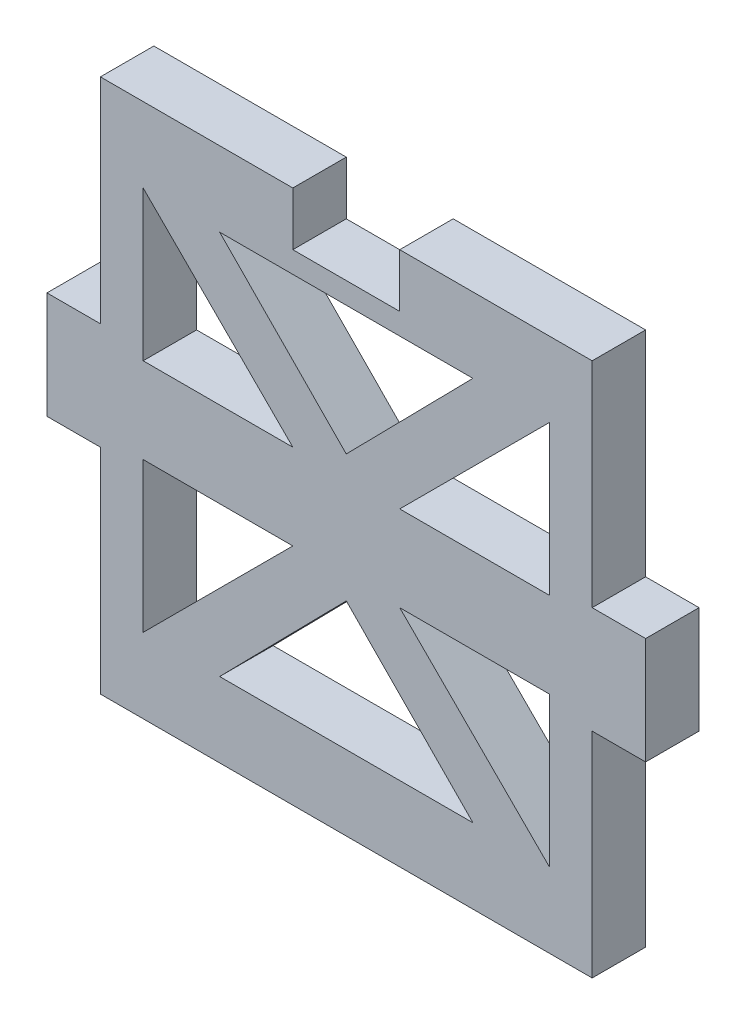
ISO-10303-21;
HEADER;
FILE_DESCRIPTION(('STEP AP214'),'2;1');
FILE_NAME('part.step','',(''),(''),'','','');
FILE_SCHEMA(('AUTOMOTIVE_DESIGN { 1 0 10303 214 1 1 1 1 }'));
ENDSEC;
DATA;
#1=APPLICATION_CONTEXT('core data for automotive mechanical design processes');
#2=APPLICATION_PROTOCOL_DEFINITION('international standard','automotive_design',2000,#1);
#3=PRODUCT_CONTEXT('',#1,'mechanical');
#4=PRODUCT('Part','Part','',(#3));
#5=PRODUCT_RELATED_PRODUCT_CATEGORY('part','',(#4));
#6=PRODUCT_DEFINITION_FORMATION('','',#4);
#7=PRODUCT_DEFINITION_CONTEXT('part definition',#1,'design');
#8=PRODUCT_DEFINITION('design','',#6,#7);
#9=PRODUCT_DEFINITION_SHAPE('','',#8);
#10=(LENGTH_UNIT() NAMED_UNIT(*) SI_UNIT(.MILLI.,.METRE.));
#11=(NAMED_UNIT(*) PLANE_ANGLE_UNIT() SI_UNIT($,.RADIAN.));
#12=(NAMED_UNIT(*) SI_UNIT($,.STERADIAN.) SOLID_ANGLE_UNIT());
#13=UNCERTAINTY_MEASURE_WITH_UNIT(LENGTH_MEASURE(1.E-05),#10,'distance_accuracy_value','');
#14=(GEOMETRIC_REPRESENTATION_CONTEXT(3) GLOBAL_UNCERTAINTY_ASSIGNED_CONTEXT((#13)) GLOBAL_UNIT_ASSIGNED_CONTEXT((#10,
#11,#12)) REPRESENTATION_CONTEXT('',''));
#15=CARTESIAN_POINT('',(0.,0.,0.));
#16=DIRECTION('',(0.,0.,1.));
#17=DIRECTION('',(1.,0.,0.));
#18=AXIS2_PLACEMENT_3D('',#15,#16,#17);
#19=CARTESIAN_POINT('',(-14.605,15.875,3.175));
#20=DIRECTION('',(1.,0.,0.));
#21=DIRECTION('',(0.,1.,0.));
#22=AXIS2_PLACEMENT_3D('',#19,#20,#21);
#23=PLANE('',#22);
#24=DIRECTION('',(0.,-1.,0.));
#25=VECTOR('',#24,1.);
#26=CARTESIAN_POINT('',(-14.605,15.875,0.));
#27=LINE('',#26,#25);
#28=CARTESIAN_POINT('',(-14.605,15.875,0.));
#29=VERTEX_POINT('',#28);
#30=CARTESIAN_POINT('',(-14.605,3.175,0.));
#31=VERTEX_POINT('',#30);
#32=EDGE_CURVE('E398',#29,#31,#27,.T.);
#33=ORIENTED_EDGE('',*,*,#32,.T.);
#34=DIRECTION('',(0.,0.,-1.));
#35=VECTOR('',#34,1.);
#36=CARTESIAN_POINT('',(-14.605,3.175,3.175));
#37=LINE('',#36,#35);
#38=CARTESIAN_POINT('',(-14.605,3.175,3.175));
#39=VERTEX_POINT('',#38);
#40=EDGE_CURVE('E11',#39,#31,#37,.T.);
#41=ORIENTED_EDGE('',*,*,#40,.F.);
#42=DIRECTION('',(0.,-1.,0.));
#43=VECTOR('',#42,1.);
#44=CARTESIAN_POINT('',(-14.605,15.875,3.175));
#45=LINE('',#44,#43);
#46=CARTESIAN_POINT('',(-14.605,15.875,3.175));
#47=VERTEX_POINT('',#46);
#48=EDGE_CURVE('E399',#47,#39,#45,.T.);
#49=ORIENTED_EDGE('',*,*,#48,.F.);
#50=DIRECTION('',(0.,0.,-1.));
#51=VECTOR('',#50,1.);
#52=CARTESIAN_POINT('',(-14.605,15.875,3.175));
#53=LINE('',#52,#51);
#54=EDGE_CURVE('E433',#47,#29,#53,.T.);
#55=ORIENTED_EDGE('',*,*,#54,.T.);
#56=EDGE_LOOP('',(#33,#41,#49,#55));
#57=FACE_BOUND('',#56,.T.);
#58=ADVANCED_FACE('F32',(#57),#23,.F.);
#59=CARTESIAN_POINT('',(-14.605,3.175,3.175));
#60=DIRECTION('',(0.,-1.,0.));
#61=DIRECTION('',(0.,0.,-1.));
#62=AXIS2_PLACEMENT_3D('',#59,#60,#61);
#63=PLANE('',#62);
#64=DIRECTION('',(-1.,0.,0.));
#65=VECTOR('',#64,1.);
#66=CARTESIAN_POINT('',(-14.605,3.175,0.));
#67=LINE('',#66,#65);
#68=CARTESIAN_POINT('',(-17.78,3.175,0.));
#69=VERTEX_POINT('',#68);
#70=EDGE_CURVE('E436',#31,#69,#67,.T.);
#71=ORIENTED_EDGE('',*,*,#70,.T.);
#72=DIRECTION('',(0.,0.,-1.));
#73=VECTOR('',#72,1.);
#74=CARTESIAN_POINT('',(-17.78,3.175,3.175));
#75=LINE('',#74,#73);
#76=CARTESIAN_POINT('',(-17.78,3.175,3.175));
#77=VERTEX_POINT('',#76);
#78=EDGE_CURVE('E39',#77,#69,#75,.T.);
#79=ORIENTED_EDGE('',*,*,#78,.F.);
#80=DIRECTION('',(-1.,0.,0.));
#81=VECTOR('',#80,1.);
#82=CARTESIAN_POINT('',(-14.605,3.175,3.175));
#83=LINE('',#82,#81);
#84=EDGE_CURVE('E402',#39,#77,#83,.T.);
#85=ORIENTED_EDGE('',*,*,#84,.F.);
#86=ORIENTED_EDGE('',*,*,#40,.T.);
#87=EDGE_LOOP('',(#71,#79,#85,#86));
#88=FACE_BOUND('',#87,.T.);
#89=ADVANCED_FACE('F532',(#88),#63,.F.);
#90=CARTESIAN_POINT('',(-17.78,3.175,3.175));
#91=DIRECTION('',(1.,0.,0.));
#92=DIRECTION('',(0.,0.,-1.));
#93=AXIS2_PLACEMENT_3D('',#90,#91,#92);
#94=PLANE('',#93);
#95=DIRECTION('',(0.,-1.,0.));
#96=VECTOR('',#95,1.);
#97=CARTESIAN_POINT('',(-17.78,3.175,0.));
#98=LINE('',#97,#96);
#99=CARTESIAN_POINT('',(-17.78,-3.175,0.));
#100=VERTEX_POINT('',#99);
#101=EDGE_CURVE('E438',#69,#100,#98,.T.);
#102=ORIENTED_EDGE('',*,*,#101,.T.);
#103=DIRECTION('',(0.,0.,-1.));
#104=VECTOR('',#103,1.);
#105=CARTESIAN_POINT('',(-17.78,-3.175,3.175));
#106=LINE('',#105,#104);
#107=CARTESIAN_POINT('',(-17.78,-3.175,3.175));
#108=VERTEX_POINT('',#107);
#109=EDGE_CURVE('E504',#108,#100,#106,.T.);
#110=ORIENTED_EDGE('',*,*,#109,.F.);
#111=DIRECTION('',(0.,-1.,0.));
#112=VECTOR('',#111,1.);
#113=CARTESIAN_POINT('',(-17.78,3.175,3.175));
#114=LINE('',#113,#112);
#115=EDGE_CURVE('E405',#77,#108,#114,.T.);
#116=ORIENTED_EDGE('',*,*,#115,.F.);
#117=ORIENTED_EDGE('',*,*,#78,.T.);
#118=EDGE_LOOP('',(#102,#110,#116,#117));
#119=FACE_BOUND('',#118,.T.);
#120=ADVANCED_FACE('F511',(#119),#94,.F.);
#121=CARTESIAN_POINT('',(-14.605,-3.175,3.175));
#122=DIRECTION('',(0.,1.,0.));
#123=DIRECTION('',(0.,0.,1.));
#124=AXIS2_PLACEMENT_3D('',#121,#122,#123);
#125=PLANE('',#124);
#126=DIRECTION('',(1.,0.,0.));
#127=VECTOR('',#126,1.);
#128=CARTESIAN_POINT('',(-14.605,-3.175,0.));
#129=LINE('',#128,#127);
#130=CARTESIAN_POINT('',(-14.605,-3.175,0.));
#131=VERTEX_POINT('',#130);
#132=EDGE_CURVE('E440',#100,#131,#129,.T.);
#133=ORIENTED_EDGE('',*,*,#132,.T.);
#134=DIRECTION('',(0.,0.,-1.));
#135=VECTOR('',#134,1.);
#136=CARTESIAN_POINT('',(-14.605,-3.175,3.175));
#137=LINE('',#136,#135);
#138=CARTESIAN_POINT('',(-14.605,-3.175,3.175));
#139=VERTEX_POINT('',#138);
#140=EDGE_CURVE('E501',#139,#131,#137,.T.);
#141=ORIENTED_EDGE('',*,*,#140,.F.);
#142=DIRECTION('',(1.,0.,0.));
#143=VECTOR('',#142,1.);
#144=CARTESIAN_POINT('',(-14.605,-3.175,3.175));
#145=LINE('',#144,#143);
#146=EDGE_CURVE('E407',#108,#139,#145,.T.);
#147=ORIENTED_EDGE('',*,*,#146,.F.);
#148=ORIENTED_EDGE('',*,*,#109,.T.);
#149=EDGE_LOOP('',(#133,#141,#147,#148));
#150=FACE_BOUND('',#149,.T.);
#151=ADVANCED_FACE('F520',(#150),#125,.F.);
#152=CARTESIAN_POINT('',(-14.605,-15.875,3.175));
#153=DIRECTION('',(1.,0.,0.));
#154=DIRECTION('',(0.,1.,0.));
#155=AXIS2_PLACEMENT_3D('',#152,#153,#154);
#156=PLANE('',#155);
#157=DIRECTION('',(0.,-1.,0.));
#158=VECTOR('',#157,1.);
#159=CARTESIAN_POINT('',(-14.605,-15.875,0.));
#160=LINE('',#159,#158);
#161=CARTESIAN_POINT('',(-14.605,-15.875,0.));
#162=VERTEX_POINT('',#161);
#163=EDGE_CURVE('E442',#131,#162,#160,.T.);
#164=ORIENTED_EDGE('',*,*,#163,.T.);
#165=DIRECTION('',(0.,0.,-1.));
#166=VECTOR('',#165,1.);
#167=CARTESIAN_POINT('',(-14.605,-15.875,3.175));
#168=LINE('',#167,#166);
#169=CARTESIAN_POINT('',(-14.605,-15.875,3.175));
#170=VERTEX_POINT('',#169);
#171=EDGE_CURVE('E498',#170,#162,#168,.T.);
#172=ORIENTED_EDGE('',*,*,#171,.F.);
#173=DIRECTION('',(0.,-1.,0.));
#174=VECTOR('',#173,1.);
#175=CARTESIAN_POINT('',(-14.605,-15.875,3.175));
#176=LINE('',#175,#174);
#177=EDGE_CURVE('E409',#139,#170,#176,.T.);
#178=ORIENTED_EDGE('',*,*,#177,.F.);
#179=ORIENTED_EDGE('',*,*,#140,.T.);
#180=EDGE_LOOP('',(#164,#172,#178,#179));
#181=FACE_BOUND('',#180,.T.);
#182=ADVANCED_FACE('F524',(#181),#156,.F.);
#183=CARTESIAN_POINT('',(14.605,-15.875,3.175));
#184=DIRECTION('',(0.,1.,0.));
#185=DIRECTION('',(-1.,0.,0.));
#186=AXIS2_PLACEMENT_3D('',#183,#184,#185);
#187=PLANE('',#186);
#188=DIRECTION('',(1.,0.,0.));
#189=VECTOR('',#188,1.);
#190=CARTESIAN_POINT('',(14.605,-15.875,0.));
#191=LINE('',#190,#189);
#192=CARTESIAN_POINT('',(14.605,-15.875,0.));
#193=VERTEX_POINT('',#192);
#194=EDGE_CURVE('E445',#162,#193,#191,.T.);
#195=ORIENTED_EDGE('',*,*,#194,.T.);
#196=DIRECTION('',(0.,0.,-1.));
#197=VECTOR('',#196,1.);
#198=CARTESIAN_POINT('',(14.605,-15.875,3.175));
#199=LINE('',#198,#197);
#200=CARTESIAN_POINT('',(14.605,-15.875,3.175));
#201=VERTEX_POINT('',#200);
#202=EDGE_CURVE('E495',#201,#193,#199,.T.);
#203=ORIENTED_EDGE('',*,*,#202,.F.);
#204=DIRECTION('',(1.,0.,0.));
#205=VECTOR('',#204,1.);
#206=CARTESIAN_POINT('',(-14.605,-15.875,3.175));
#207=LINE('',#206,#205);
#208=EDGE_CURVE('E411',#170,#201,#207,.T.);
#209=ORIENTED_EDGE('',*,*,#208,.F.);
#210=ORIENTED_EDGE('',*,*,#171,.T.);
#211=EDGE_LOOP('',(#195,#203,#209,#210));
#212=FACE_BOUND('',#211,.T.);
#213=ADVANCED_FACE('F585',(#212),#187,.F.);
#214=CARTESIAN_POINT('',(14.605,-15.875,3.175));
#215=DIRECTION('',(-1.,0.,0.));
#216=DIRECTION('',(0.,-1.,0.));
#217=AXIS2_PLACEMENT_3D('',#214,#215,#216);
#218=PLANE('',#217);
#219=DIRECTION('',(0.,1.,0.));
#220=VECTOR('',#219,1.);
#221=CARTESIAN_POINT('',(14.605,-15.875,0.));
#222=LINE('',#221,#220);
#223=CARTESIAN_POINT('',(14.605,-3.175,0.));
#224=VERTEX_POINT('',#223);
#225=EDGE_CURVE('E447',#193,#224,#222,.T.);
#226=ORIENTED_EDGE('',*,*,#225,.T.);
#227=DIRECTION('',(0.,0.,-1.));
#228=VECTOR('',#227,1.);
#229=CARTESIAN_POINT('',(14.605,-3.175,3.175));
#230=LINE('',#229,#228);
#231=CARTESIAN_POINT('',(14.605,-3.175,3.175));
#232=VERTEX_POINT('',#231);
#233=EDGE_CURVE('E492',#232,#224,#230,.T.);
#234=ORIENTED_EDGE('',*,*,#233,.F.);
#235=DIRECTION('',(0.,1.,0.));
#236=VECTOR('',#235,1.);
#237=CARTESIAN_POINT('',(14.605,-15.875,3.175));
#238=LINE('',#237,#236);
#239=EDGE_CURVE('E413',#201,#232,#238,.T.);
#240=ORIENTED_EDGE('',*,*,#239,.F.);
#241=ORIENTED_EDGE('',*,*,#202,.T.);
#242=EDGE_LOOP('',(#226,#234,#240,#241));
#243=FACE_BOUND('',#242,.T.);
#244=ADVANCED_FACE('F582',(#243),#218,.F.);
#245=CARTESIAN_POINT('',(14.605,-3.175,3.175));
#246=DIRECTION('',(0.,1.,0.));
#247=DIRECTION('',(0.,0.,1.));
#248=AXIS2_PLACEMENT_3D('',#245,#246,#247);
#249=PLANE('',#248);
#250=DIRECTION('',(1.,0.,0.));
#251=VECTOR('',#250,1.);
#252=CARTESIAN_POINT('',(14.605,-3.175,0.));
#253=LINE('',#252,#251);
#254=CARTESIAN_POINT('',(17.78,-3.175,0.));
#255=VERTEX_POINT('',#254);
#256=EDGE_CURVE('E449',#224,#255,#253,.T.);
#257=ORIENTED_EDGE('',*,*,#256,.T.);
#258=DIRECTION('',(0.,0.,-1.));
#259=VECTOR('',#258,1.);
#260=CARTESIAN_POINT('',(17.78,-3.175,3.175));
#261=LINE('',#260,#259);
#262=CARTESIAN_POINT('',(17.78,-3.175,3.175));
#263=VERTEX_POINT('',#262);
#264=EDGE_CURVE('E489',#263,#255,#261,.T.);
#265=ORIENTED_EDGE('',*,*,#264,.F.);
#266=DIRECTION('',(1.,0.,0.));
#267=VECTOR('',#266,1.);
#268=CARTESIAN_POINT('',(14.605,-3.175,3.175));
#269=LINE('',#268,#267);
#270=EDGE_CURVE('E415',#232,#263,#269,.T.);
#271=ORIENTED_EDGE('',*,*,#270,.F.);
#272=ORIENTED_EDGE('',*,*,#233,.T.);
#273=EDGE_LOOP('',(#257,#265,#271,#272));
#274=FACE_BOUND('',#273,.T.);
#275=ADVANCED_FACE('F578',(#274),#249,.F.);
#276=CARTESIAN_POINT('',(17.78,3.175,3.175));
#277=DIRECTION('',(-1.,0.,0.));
#278=DIRECTION('',(0.,0.,1.));
#279=AXIS2_PLACEMENT_3D('',#276,#277,#278);
#280=PLANE('',#279);
#281=DIRECTION('',(0.,1.,0.));
#282=VECTOR('',#281,1.);
#283=CARTESIAN_POINT('',(17.78,3.175,0.));
#284=LINE('',#283,#282);
#285=CARTESIAN_POINT('',(17.78,3.175,0.));
#286=VERTEX_POINT('',#285);
#287=EDGE_CURVE('E451',#255,#286,#284,.T.);
#288=ORIENTED_EDGE('',*,*,#287,.T.);
#289=DIRECTION('',(0.,0.,-1.));
#290=VECTOR('',#289,1.);
#291=CARTESIAN_POINT('',(17.78,3.175,3.175));
#292=LINE('',#291,#290);
#293=CARTESIAN_POINT('',(17.78,3.175,3.175));
#294=VERTEX_POINT('',#293);
#295=EDGE_CURVE('E486',#294,#286,#292,.T.);
#296=ORIENTED_EDGE('',*,*,#295,.F.);
#297=DIRECTION('',(0.,1.,0.));
#298=VECTOR('',#297,1.);
#299=CARTESIAN_POINT('',(17.78,3.175,3.175));
#300=LINE('',#299,#298);
#301=EDGE_CURVE('E417',#263,#294,#300,.T.);
#302=ORIENTED_EDGE('',*,*,#301,.F.);
#303=ORIENTED_EDGE('',*,*,#264,.T.);
#304=EDGE_LOOP('',(#288,#296,#302,#303));
#305=FACE_BOUND('',#304,.T.);
#306=ADVANCED_FACE('F574',(#305),#280,.F.);
#307=CARTESIAN_POINT('',(14.605,3.175,3.175));
#308=DIRECTION('',(0.,-1.,0.));
#309=DIRECTION('',(0.,0.,-1.));
#310=AXIS2_PLACEMENT_3D('',#307,#308,#309);
#311=PLANE('',#310);
#312=DIRECTION('',(-1.,0.,0.));
#313=VECTOR('',#312,1.);
#314=CARTESIAN_POINT('',(14.605,3.175,0.));
#315=LINE('',#314,#313);
#316=CARTESIAN_POINT('',(14.605,3.175,0.));
#317=VERTEX_POINT('',#316);
#318=EDGE_CURVE('E453',#286,#317,#315,.T.);
#319=ORIENTED_EDGE('',*,*,#318,.T.);
#320=DIRECTION('',(0.,0.,-1.));
#321=VECTOR('',#320,1.);
#322=CARTESIAN_POINT('',(14.605,3.175,3.175));
#323=LINE('',#322,#321);
#324=CARTESIAN_POINT('',(14.605,3.175,3.175));
#325=VERTEX_POINT('',#324);
#326=EDGE_CURVE('E483',#325,#317,#323,.T.);
#327=ORIENTED_EDGE('',*,*,#326,.F.);
#328=DIRECTION('',(-1.,0.,0.));
#329=VECTOR('',#328,1.);
#330=CARTESIAN_POINT('',(14.605,3.175,3.175));
#331=LINE('',#330,#329);
#332=EDGE_CURVE('E419',#294,#325,#331,.T.);
#333=ORIENTED_EDGE('',*,*,#332,.F.);
#334=ORIENTED_EDGE('',*,*,#295,.T.);
#335=EDGE_LOOP('',(#319,#327,#333,#334));
#336=FACE_BOUND('',#335,.T.);
#337=ADVANCED_FACE('F569',(#336),#311,.F.);
#338=CARTESIAN_POINT('',(14.605,15.875,3.175));
#339=DIRECTION('',(-1.,0.,0.));
#340=DIRECTION('',(0.,-1.,0.));
#341=AXIS2_PLACEMENT_3D('',#338,#339,#340);
#342=PLANE('',#341);
#343=DIRECTION('',(0.,1.,0.));
#344=VECTOR('',#343,1.);
#345=CARTESIAN_POINT('',(14.605,15.875,0.));
#346=LINE('',#345,#344);
#347=CARTESIAN_POINT('',(14.605,15.875,0.));
#348=VERTEX_POINT('',#347);
#349=EDGE_CURVE('E455',#317,#348,#346,.T.);
#350=ORIENTED_EDGE('',*,*,#349,.T.);
#351=DIRECTION('',(0.,0.,-1.));
#352=VECTOR('',#351,1.);
#353=CARTESIAN_POINT('',(14.605,15.875,3.175));
#354=LINE('',#353,#352);
#355=CARTESIAN_POINT('',(14.605,15.875,3.175));
#356=VERTEX_POINT('',#355);
#357=EDGE_CURVE('E480',#356,#348,#354,.T.);
#358=ORIENTED_EDGE('',*,*,#357,.F.);
#359=DIRECTION('',(0.,1.,0.));
#360=VECTOR('',#359,1.);
#361=CARTESIAN_POINT('',(14.605,15.875,3.175));
#362=LINE('',#361,#360);
#363=EDGE_CURVE('E421',#325,#356,#362,.T.);
#364=ORIENTED_EDGE('',*,*,#363,.F.);
#365=ORIENTED_EDGE('',*,*,#326,.T.);
#366=EDGE_LOOP('',(#350,#358,#364,#365));
#367=FACE_BOUND('',#366,.T.);
#368=ADVANCED_FACE('F563',(#367),#342,.F.);
#369=CARTESIAN_POINT('',(14.605,15.875,3.175));
#370=DIRECTION('',(0.,-1.,0.));
#371=DIRECTION('',(1.,0.,0.));
#372=AXIS2_PLACEMENT_3D('',#369,#370,#371);
#373=PLANE('',#372);
#374=DIRECTION('',(-1.,0.,0.));
#375=VECTOR('',#374,1.);
#376=CARTESIAN_POINT('',(14.605,15.875,0.));
#377=LINE('',#376,#375);
#378=CARTESIAN_POINT('',(3.175,15.875,0.));
#379=VERTEX_POINT('',#378);
#380=EDGE_CURVE('E457',#348,#379,#377,.T.);
#381=ORIENTED_EDGE('',*,*,#380,.T.);
#382=DIRECTION('',(0.,0.,-1.));
#383=VECTOR('',#382,1.);
#384=CARTESIAN_POINT('',(3.175,15.875,3.175));
#385=LINE('',#384,#383);
#386=CARTESIAN_POINT('',(3.175,15.875,3.175));
#387=VERTEX_POINT('',#386);
#388=EDGE_CURVE('E477',#387,#379,#385,.T.);
#389=ORIENTED_EDGE('',*,*,#388,.F.);
#390=DIRECTION('',(-1.,0.,0.));
#391=VECTOR('',#390,1.);
#392=CARTESIAN_POINT('',(14.605,15.875,3.175));
#393=LINE('',#392,#391);
#394=EDGE_CURVE('E423',#356,#387,#393,.T.);
#395=ORIENTED_EDGE('',*,*,#394,.F.);
#396=ORIENTED_EDGE('',*,*,#357,.T.);
#397=EDGE_LOOP('',(#381,#389,#395,#396));
#398=FACE_BOUND('',#397,.T.);
#399=ADVANCED_FACE('F559',(#398),#373,.F.);
#400=CARTESIAN_POINT('',(3.175,12.7,3.175));
#401=DIRECTION('',(1.,0.,0.));
#402=DIRECTION('',(0.,1.,0.));
#403=AXIS2_PLACEMENT_3D('',#400,#401,#402);
#404=PLANE('',#403);
#405=DIRECTION('',(0.,-1.,0.));
#406=VECTOR('',#405,1.);
#407=CARTESIAN_POINT('',(3.175,12.7,0.));
#408=LINE('',#407,#406);
#409=CARTESIAN_POINT('',(3.175,12.7,0.));
#410=VERTEX_POINT('',#409);
#411=EDGE_CURVE('E459',#379,#410,#408,.T.);
#412=ORIENTED_EDGE('',*,*,#411,.T.);
#413=DIRECTION('',(0.,0.,-1.));
#414=VECTOR('',#413,1.);
#415=CARTESIAN_POINT('',(3.175,12.7,3.175));
#416=LINE('',#415,#414);
#417=CARTESIAN_POINT('',(3.175,12.7,3.175));
#418=VERTEX_POINT('',#417);
#419=EDGE_CURVE('E474',#418,#410,#416,.T.);
#420=ORIENTED_EDGE('',*,*,#419,.F.);
#421=DIRECTION('',(0.,-1.,0.));
#422=VECTOR('',#421,1.);
#423=CARTESIAN_POINT('',(3.175,12.7,3.175));
#424=LINE('',#423,#422);
#425=EDGE_CURVE('E425',#387,#418,#424,.T.);
#426=ORIENTED_EDGE('',*,*,#425,.F.);
#427=ORIENTED_EDGE('',*,*,#388,.T.);
#428=EDGE_LOOP('',(#412,#420,#426,#427));
#429=FACE_BOUND('',#428,.T.);
#430=ADVANCED_FACE('F554',(#429),#404,.F.);
#431=CARTESIAN_POINT('',(-3.175,12.7,3.175));
#432=DIRECTION('',(0.,-1.,0.));
#433=DIRECTION('',(1.,0.,0.));
#434=AXIS2_PLACEMENT_3D('',#431,#432,#433);
#435=PLANE('',#434);
#436=DIRECTION('',(-1.,0.,0.));
#437=VECTOR('',#436,1.);
#438=CARTESIAN_POINT('',(-3.175,12.7,0.));
#439=LINE('',#438,#437);
#440=CARTESIAN_POINT('',(-3.175,12.7,0.));
#441=VERTEX_POINT('',#440);
#442=EDGE_CURVE('E461',#410,#441,#439,.T.);
#443=ORIENTED_EDGE('',*,*,#442,.T.);
#444=DIRECTION('',(0.,0.,-1.));
#445=VECTOR('',#444,1.);
#446=CARTESIAN_POINT('',(-3.175,12.7,3.175));
#447=LINE('',#446,#445);
#448=CARTESIAN_POINT('',(-3.175,12.7,3.175));
#449=VERTEX_POINT('',#448);
#450=EDGE_CURVE('E471',#449,#441,#447,.T.);
#451=ORIENTED_EDGE('',*,*,#450,.F.);
#452=DIRECTION('',(-1.,0.,0.));
#453=VECTOR('',#452,1.);
#454=CARTESIAN_POINT('',(-3.175,12.7,3.175));
#455=LINE('',#454,#453);
#456=EDGE_CURVE('E427',#418,#449,#455,.T.);
#457=ORIENTED_EDGE('',*,*,#456,.F.);
#458=ORIENTED_EDGE('',*,*,#419,.T.);
#459=EDGE_LOOP('',(#443,#451,#457,#458));
#460=FACE_BOUND('',#459,.T.);
#461=ADVANCED_FACE('F548',(#460),#435,.F.);
#462=CARTESIAN_POINT('',(-3.175,15.875,3.175));
#463=DIRECTION('',(-1.,0.,0.));
#464=DIRECTION('',(0.,-1.,0.));
#465=AXIS2_PLACEMENT_3D('',#462,#463,#464);
#466=PLANE('',#465);
#467=DIRECTION('',(0.,1.,0.));
#468=VECTOR('',#467,1.);
#469=CARTESIAN_POINT('',(-3.175,15.875,0.));
#470=LINE('',#469,#468);
#471=CARTESIAN_POINT('',(-3.175,15.875,0.));
#472=VERTEX_POINT('',#471);
#473=EDGE_CURVE('E463',#441,#472,#470,.T.);
#474=ORIENTED_EDGE('',*,*,#473,.T.);
#475=DIRECTION('',(0.,0.,-1.));
#476=VECTOR('',#475,1.);
#477=CARTESIAN_POINT('',(-3.175,15.875,3.175));
#478=LINE('',#477,#476);
#479=CARTESIAN_POINT('',(-3.175,15.875,3.175));
#480=VERTEX_POINT('',#479);
#481=EDGE_CURVE('E468',#480,#472,#478,.T.);
#482=ORIENTED_EDGE('',*,*,#481,.F.);
#483=DIRECTION('',(0.,1.,0.));
#484=VECTOR('',#483,1.);
#485=CARTESIAN_POINT('',(-3.175,15.875,3.175));
#486=LINE('',#485,#484);
#487=EDGE_CURVE('E429',#449,#480,#486,.T.);
#488=ORIENTED_EDGE('',*,*,#487,.F.);
#489=ORIENTED_EDGE('',*,*,#450,.T.);
#490=EDGE_LOOP('',(#474,#482,#488,#489));
#491=FACE_BOUND('',#490,.T.);
#492=ADVANCED_FACE('F544',(#491),#466,.F.);
#493=CARTESIAN_POINT('',(-14.605,15.875,3.175));
#494=DIRECTION('',(0.,-1.,0.));
#495=DIRECTION('',(1.,0.,0.));
#496=AXIS2_PLACEMENT_3D('',#493,#494,#495);
#497=PLANE('',#496);
#498=DIRECTION('',(-1.,0.,0.));
#499=VECTOR('',#498,1.);
#500=CARTESIAN_POINT('',(-14.605,15.875,0.));
#501=LINE('',#500,#499);
#502=EDGE_CURVE('E403',#472,#29,#501,.T.);
#503=ORIENTED_EDGE('',*,*,#502,.T.);
#504=ORIENTED_EDGE('',*,*,#54,.F.);
#505=DIRECTION('',(-1.,0.,0.));
#506=VECTOR('',#505,1.);
#507=CARTESIAN_POINT('',(-14.605,15.875,3.175));
#508=LINE('',#507,#506);
#509=EDGE_CURVE('E431',#480,#47,#508,.T.);
#510=ORIENTED_EDGE('',*,*,#509,.F.);
#511=ORIENTED_EDGE('',*,*,#481,.T.);
#512=EDGE_LOOP('',(#503,#504,#510,#511));
#513=FACE_BOUND('',#512,.T.);
#514=ADVANCED_FACE('F539',(#513),#497,.F.);
#515=CARTESIAN_POINT('',(-14.605,3.175,3.175));
#516=DIRECTION('',(0.,0.,-1.));
#517=DIRECTION('',(-1.,0.,0.));
#518=AXIS2_PLACEMENT_3D('',#515,#516,#517);
#519=PLANE('',#518);
#520=DIRECTION('',(1.,0.,0.));
#521=VECTOR('',#520,1.);
#522=CARTESIAN_POINT('',(-7.52210748880191,-11.43,3.175));
#523=LINE('',#522,#521);
#524=CARTESIAN_POINT('',(-7.52210748880191,-11.43,3.175));
#525=VERTEX_POINT('',#524);
#526=CARTESIAN_POINT('',(7.52210748880191,-11.43,3.175));
#527=VERTEX_POINT('',#526);
#528=EDGE_CURVE('E270',#525,#527,#523,.T.);
#529=ORIENTED_EDGE('',*,*,#528,.F.);
#530=DIRECTION('',(-0.70104168029465,-0.713120300152544,0.));
#531=VECTOR('',#530,1.);
#532=CARTESIAN_POINT('',(0.,-3.77829012172351,3.175));
#533=LINE('',#532,#531);
#534=CARTESIAN_POINT('',(0.,-3.77829012172351,3.175));
#535=VERTEX_POINT('',#534);
#536=EDGE_CURVE('E46',#535,#525,#533,.T.);
#537=ORIENTED_EDGE('',*,*,#536,.F.);
#538=DIRECTION('',(-0.70104168029465,0.713120300152544,0.));
#539=VECTOR('',#538,1.);
#540=CARTESIAN_POINT('',(0.,-3.77829012172351,3.175));
#541=LINE('',#540,#539);
#542=EDGE_CURVE('E264',#527,#535,#541,.T.);
#543=ORIENTED_EDGE('',*,*,#542,.F.);
#544=EDGE_LOOP('',(#529,#537,#543));
#545=FACE_BOUND('',#544,.T.);
#546=DIRECTION('',(0.70104168029465,0.713120300152544,0.));
#547=VECTOR('',#546,1.);
#548=CARTESIAN_POINT('',(0.,3.77829012172351,3.175));
#549=LINE('',#548,#547);
#550=CARTESIAN_POINT('',(0.,3.77829012172351,3.175));
#551=VERTEX_POINT('',#550);
#552=CARTESIAN_POINT('',(7.52210748880191,11.43,3.175));
#553=VERTEX_POINT('',#552);
#554=EDGE_CURVE('E286',#551,#553,#549,.T.);
#555=ORIENTED_EDGE('',*,*,#554,.F.);
#556=DIRECTION('',(0.70104168029465,-0.713120300152544,0.));
#557=VECTOR('',#556,1.);
#558=CARTESIAN_POINT('',(0.,3.77829012172351,3.175));
#559=LINE('',#558,#557);
#560=CARTESIAN_POINT('',(-7.52210748880191,11.43,3.175));
#561=VERTEX_POINT('',#560);
#562=EDGE_CURVE('E284',#561,#551,#559,.T.);
#563=ORIENTED_EDGE('',*,*,#562,.F.);
#564=DIRECTION('',(-1.,0.,0.));
#565=VECTOR('',#564,1.);
#566=CARTESIAN_POINT('',(-7.52210748880191,11.43,3.175));
#567=LINE('',#566,#565);
#568=EDGE_CURVE('E289',#553,#561,#567,.T.);
#569=ORIENTED_EDGE('',*,*,#568,.F.);
#570=EDGE_LOOP('',(#555,#563,#569));
#571=FACE_BOUND('',#570,.T.);
#572=DIRECTION('',(-1.,0.,0.));
#573=VECTOR('',#572,1.);
#574=CARTESIAN_POINT('',(12.065,-2.54,3.175));
#575=LINE('',#574,#573);
#576=CARTESIAN_POINT('',(12.065,-2.54,3.175));
#577=VERTEX_POINT('',#576);
#578=CARTESIAN_POINT('',(3.175,-2.54,3.175));
#579=VERTEX_POINT('',#578);
#580=EDGE_CURVE('E310',#577,#579,#575,.T.);
#581=ORIENTED_EDGE('',*,*,#580,.F.);
#582=DIRECTION('',(0.,1.,0.));
#583=VECTOR('',#582,1.);
#584=CARTESIAN_POINT('',(12.065,-11.43,3.175));
#585=LINE('',#584,#583);
#586=CARTESIAN_POINT('',(12.065,-11.43,3.175));
#587=VERTEX_POINT('',#586);
#588=EDGE_CURVE('E308',#587,#577,#585,.T.);
#589=ORIENTED_EDGE('',*,*,#588,.F.);
#590=DIRECTION('',(0.707106781186548,-0.707106781186548,0.));
#591=VECTOR('',#590,1.);
#592=CARTESIAN_POINT('',(3.175,-2.54,3.175));
#593=LINE('',#592,#591);
#594=EDGE_CURVE('E313',#579,#587,#593,.T.);
#595=ORIENTED_EDGE('',*,*,#594,.F.);
#596=EDGE_LOOP('',(#581,#589,#595));
#597=FACE_BOUND('',#596,.T.);
#598=DIRECTION('',(0.,-1.,0.));
#599=VECTOR('',#598,1.);
#600=CARTESIAN_POINT('',(-12.065,-11.43,3.175));
#601=LINE('',#600,#599);
#602=CARTESIAN_POINT('',(-12.065,-2.54,3.175));
#603=VERTEX_POINT('',#602);
#604=CARTESIAN_POINT('',(-12.065,-11.43,3.175));
#605=VERTEX_POINT('',#604);
#606=EDGE_CURVE('E334',#603,#605,#601,.T.);
#607=ORIENTED_EDGE('',*,*,#606,.F.);
#608=DIRECTION('',(-1.,0.,0.));
#609=VECTOR('',#608,1.);
#610=CARTESIAN_POINT('',(-12.065,-2.54,3.175));
#611=LINE('',#610,#609);
#612=CARTESIAN_POINT('',(-3.175,-2.54,3.175));
#613=VERTEX_POINT('',#612);
#614=EDGE_CURVE('E332',#613,#603,#611,.T.);
#615=ORIENTED_EDGE('',*,*,#614,.F.);
#616=DIRECTION('',(0.707106781186548,0.707106781186548,0.));
#617=VECTOR('',#616,1.);
#618=CARTESIAN_POINT('',(-3.175,-2.54,3.175));
#619=LINE('',#618,#617);
#620=EDGE_CURVE('E337',#605,#613,#619,.T.);
#621=ORIENTED_EDGE('',*,*,#620,.F.);
#622=EDGE_LOOP('',(#607,#615,#621));
#623=FACE_BOUND('',#622,.T.);
#624=DIRECTION('',(1.,0.,0.));
#625=VECTOR('',#624,1.);
#626=CARTESIAN_POINT('',(-12.065,2.54,3.175));
#627=LINE('',#626,#625);
#628=CARTESIAN_POINT('',(-12.065,2.54,3.175));
#629=VERTEX_POINT('',#628);
#630=CARTESIAN_POINT('',(-3.175,2.54,3.175));
#631=VERTEX_POINT('',#630);
#632=EDGE_CURVE('E358',#629,#631,#627,.T.);
#633=ORIENTED_EDGE('',*,*,#632,.F.);
#634=DIRECTION('',(0.,-1.,0.));
#635=VECTOR('',#634,1.);
#636=CARTESIAN_POINT('',(-12.065,11.43,3.175));
#637=LINE('',#636,#635);
#638=CARTESIAN_POINT('',(-12.065,11.43,3.175));
#639=VERTEX_POINT('',#638);
#640=EDGE_CURVE('E356',#639,#629,#637,.T.);
#641=ORIENTED_EDGE('',*,*,#640,.F.);
#642=DIRECTION('',(-0.707106781186548,0.707106781186548,0.));
#643=VECTOR('',#642,1.);
#644=CARTESIAN_POINT('',(-3.175,2.54,3.175));
#645=LINE('',#644,#643);
#646=EDGE_CURVE('E361',#631,#639,#645,.T.);
#647=ORIENTED_EDGE('',*,*,#646,.F.);
#648=EDGE_LOOP('',(#633,#641,#647));
#649=FACE_BOUND('',#648,.T.);
#650=DIRECTION('',(-0.707106781186548,-0.707106781186548,0.));
#651=VECTOR('',#650,1.);
#652=CARTESIAN_POINT('',(3.175,2.54,3.175));
#653=LINE('',#652,#651);
#654=CARTESIAN_POINT('',(12.065,11.43,3.175));
#655=VERTEX_POINT('',#654);
#656=CARTESIAN_POINT('',(3.175,2.54,3.175));
#657=VERTEX_POINT('',#656);
#658=EDGE_CURVE('E382',#655,#657,#653,.T.);
#659=ORIENTED_EDGE('',*,*,#658,.F.);
#660=DIRECTION('',(0.,1.,0.));
#661=VECTOR('',#660,1.);
#662=CARTESIAN_POINT('',(12.065,11.43,3.175));
#663=LINE('',#662,#661);
#664=CARTESIAN_POINT('',(12.065,2.54,3.175));
#665=VERTEX_POINT('',#664);
#666=EDGE_CURVE('E380',#665,#655,#663,.T.);
#667=ORIENTED_EDGE('',*,*,#666,.F.);
#668=DIRECTION('',(1.,0.,0.));
#669=VECTOR('',#668,1.);
#670=CARTESIAN_POINT('',(12.065,2.54,3.175));
#671=LINE('',#670,#669);
#672=EDGE_CURVE('E385',#657,#665,#671,.T.);
#673=ORIENTED_EDGE('',*,*,#672,.F.);
#674=EDGE_LOOP('',(#659,#667,#673));
#675=FACE_BOUND('',#674,.T.);
#676=ORIENTED_EDGE('',*,*,#48,.T.);
#677=ORIENTED_EDGE('',*,*,#84,.T.);
#678=ORIENTED_EDGE('',*,*,#115,.T.);
#679=ORIENTED_EDGE('',*,*,#146,.T.);
#680=ORIENTED_EDGE('',*,*,#177,.T.);
#681=ORIENTED_EDGE('',*,*,#208,.T.);
#682=ORIENTED_EDGE('',*,*,#239,.T.);
#683=ORIENTED_EDGE('',*,*,#270,.T.);
#684=ORIENTED_EDGE('',*,*,#301,.T.);
#685=ORIENTED_EDGE('',*,*,#332,.T.);
#686=ORIENTED_EDGE('',*,*,#363,.T.);
#687=ORIENTED_EDGE('',*,*,#394,.T.);
#688=ORIENTED_EDGE('',*,*,#425,.T.);
#689=ORIENTED_EDGE('',*,*,#456,.T.);
#690=ORIENTED_EDGE('',*,*,#487,.T.);
#691=ORIENTED_EDGE('',*,*,#509,.T.);
#692=EDGE_LOOP('',(#676,#677,#678,#679,#680,#681,#682,#683,#684,#685,#686,#687,#688,#689,#690,#691));
#693=FACE_BOUND('',#692,.T.);
#694=ADVANCED_FACE('F528',(#545,#571,#597,#623,#649,#675,#693),#519,.F.);
#695=CARTESIAN_POINT('',(-14.605,3.175,0.));
#696=DIRECTION('',(0.,0.,-1.));
#697=DIRECTION('',(-1.,0.,0.));
#698=AXIS2_PLACEMENT_3D('',#695,#696,#697);
#699=PLANE('',#698);
#700=DIRECTION('',(-0.70104168029465,-0.713120300152544,0.));
#701=VECTOR('',#700,1.);
#702=CARTESIAN_POINT('',(0.,-3.77829012172351,0.));
#703=LINE('',#702,#701);
#704=CARTESIAN_POINT('',(0.,-3.77829012172351,0.));
#705=VERTEX_POINT('',#704);
#706=CARTESIAN_POINT('',(-7.52210748880191,-11.43,0.));
#707=VERTEX_POINT('',#706);
#708=EDGE_CURVE('E262',#705,#707,#703,.T.);
#709=ORIENTED_EDGE('',*,*,#708,.T.);
#710=DIRECTION('',(1.,0.,0.));
#711=VECTOR('',#710,1.);
#712=CARTESIAN_POINT('',(-7.52210748880191,-11.43,0.));
#713=LINE('',#712,#711);
#714=CARTESIAN_POINT('',(7.52210748880191,-11.43,0.));
#715=VERTEX_POINT('',#714);
#716=EDGE_CURVE('E251',#707,#715,#713,.T.);
#717=ORIENTED_EDGE('',*,*,#716,.T.);
#718=DIRECTION('',(-0.70104168029465,0.713120300152544,0.));
#719=VECTOR('',#718,1.);
#720=CARTESIAN_POINT('',(0.,-3.77829012172351,0.));
#721=LINE('',#720,#719);
#722=EDGE_CURVE('E268',#715,#705,#721,.T.);
#723=ORIENTED_EDGE('',*,*,#722,.T.);
#724=EDGE_LOOP('',(#709,#717,#723));
#725=FACE_BOUND('',#724,.T.);
#726=DIRECTION('',(0.70104168029465,-0.713120300152544,0.));
#727=VECTOR('',#726,1.);
#728=CARTESIAN_POINT('',(0.,3.77829012172351,0.));
#729=LINE('',#728,#727);
#730=CARTESIAN_POINT('',(-7.52210748880191,11.43,0.));
#731=VERTEX_POINT('',#730);
#732=CARTESIAN_POINT('',(0.,3.77829012172351,0.));
#733=VERTEX_POINT('',#732);
#734=EDGE_CURVE('E281',#731,#733,#729,.T.);
#735=ORIENTED_EDGE('',*,*,#734,.T.);
#736=DIRECTION('',(0.70104168029465,0.713120300152544,0.));
#737=VECTOR('',#736,1.);
#738=CARTESIAN_POINT('',(0.,3.77829012172351,0.));
#739=LINE('',#738,#737);
#740=CARTESIAN_POINT('',(7.52210748880191,11.43,0.));
#741=VERTEX_POINT('',#740);
#742=EDGE_CURVE('E295',#733,#741,#739,.T.);
#743=ORIENTED_EDGE('',*,*,#742,.T.);
#744=DIRECTION('',(-1.,0.,0.));
#745=VECTOR('',#744,1.);
#746=CARTESIAN_POINT('',(-7.52210748880191,11.43,0.));
#747=LINE('',#746,#745);
#748=EDGE_CURVE('E258',#741,#731,#747,.T.);
#749=ORIENTED_EDGE('',*,*,#748,.T.);
#750=EDGE_LOOP('',(#735,#743,#749));
#751=FACE_BOUND('',#750,.T.);
#752=DIRECTION('',(0.,1.,0.));
#753=VECTOR('',#752,1.);
#754=CARTESIAN_POINT('',(12.065,-11.43,0.));
#755=LINE('',#754,#753);
#756=CARTESIAN_POINT('',(12.065,-11.43,0.));
#757=VERTEX_POINT('',#756);
#758=CARTESIAN_POINT('',(12.065,-2.54,0.));
#759=VERTEX_POINT('',#758);
#760=EDGE_CURVE('E305',#757,#759,#755,.T.);
#761=ORIENTED_EDGE('',*,*,#760,.T.);
#762=DIRECTION('',(-1.,0.,0.));
#763=VECTOR('',#762,1.);
#764=CARTESIAN_POINT('',(12.065,-2.54,0.));
#765=LINE('',#764,#763);
#766=CARTESIAN_POINT('',(3.175,-2.54,0.));
#767=VERTEX_POINT('',#766);
#768=EDGE_CURVE('E319',#759,#767,#765,.T.);
#769=ORIENTED_EDGE('',*,*,#768,.T.);
#770=DIRECTION('',(0.707106781186547,-0.707106781186548,0.));
#771=VECTOR('',#770,1.);
#772=CARTESIAN_POINT('',(3.175,-2.54,0.));
#773=LINE('',#772,#771);
#774=EDGE_CURVE('E302',#767,#757,#773,.T.);
#775=ORIENTED_EDGE('',*,*,#774,.T.);
#776=EDGE_LOOP('',(#761,#769,#775));
#777=FACE_BOUND('',#776,.T.);
#778=DIRECTION('',(-1.,0.,0.));
#779=VECTOR('',#778,1.);
#780=CARTESIAN_POINT('',(-12.065,-2.54,0.));
#781=LINE('',#780,#779);
#782=CARTESIAN_POINT('',(-3.175,-2.54,0.));
#783=VERTEX_POINT('',#782);
#784=CARTESIAN_POINT('',(-12.065,-2.54,0.));
#785=VERTEX_POINT('',#784);
#786=EDGE_CURVE('E329',#783,#785,#781,.T.);
#787=ORIENTED_EDGE('',*,*,#786,.T.);
#788=DIRECTION('',(0.,-1.,0.));
#789=VECTOR('',#788,1.);
#790=CARTESIAN_POINT('',(-12.065,-11.43,0.));
#791=LINE('',#790,#789);
#792=CARTESIAN_POINT('',(-12.065,-11.43,0.));
#793=VERTEX_POINT('',#792);
#794=EDGE_CURVE('E343',#785,#793,#791,.T.);
#795=ORIENTED_EDGE('',*,*,#794,.T.);
#796=DIRECTION('',(0.707106781186547,0.707106781186548,0.));
#797=VECTOR('',#796,1.);
#798=CARTESIAN_POINT('',(-3.175,-2.54,0.));
#799=LINE('',#798,#797);
#800=EDGE_CURVE('E326',#793,#783,#799,.T.);
#801=ORIENTED_EDGE('',*,*,#800,.T.);
#802=EDGE_LOOP('',(#787,#795,#801));
#803=FACE_BOUND('',#802,.T.);
#804=DIRECTION('',(0.,-1.,0.));
#805=VECTOR('',#804,1.);
#806=CARTESIAN_POINT('',(-12.065,11.43,0.));
#807=LINE('',#806,#805);
#808=CARTESIAN_POINT('',(-12.065,11.43,0.));
#809=VERTEX_POINT('',#808);
#810=CARTESIAN_POINT('',(-12.065,2.54,0.));
#811=VERTEX_POINT('',#810);
#812=EDGE_CURVE('E353',#809,#811,#807,.T.);
#813=ORIENTED_EDGE('',*,*,#812,.T.);
#814=DIRECTION('',(1.,0.,0.));
#815=VECTOR('',#814,1.);
#816=CARTESIAN_POINT('',(-12.065,2.54,0.));
#817=LINE('',#816,#815);
#818=CARTESIAN_POINT('',(-3.175,2.54,0.));
#819=VERTEX_POINT('',#818);
#820=EDGE_CURVE('E367',#811,#819,#817,.T.);
#821=ORIENTED_EDGE('',*,*,#820,.T.);
#822=DIRECTION('',(-0.707106781186547,0.707106781186548,0.));
#823=VECTOR('',#822,1.);
#824=CARTESIAN_POINT('',(-3.175,2.54,0.));
#825=LINE('',#824,#823);
#826=EDGE_CURVE('E350',#819,#809,#825,.T.);
#827=ORIENTED_EDGE('',*,*,#826,.T.);
#828=EDGE_LOOP('',(#813,#821,#827));
#829=FACE_BOUND('',#828,.T.);
#830=DIRECTION('',(0.,1.,0.));
#831=VECTOR('',#830,1.);
#832=CARTESIAN_POINT('',(12.065,11.43,0.));
#833=LINE('',#832,#831);
#834=CARTESIAN_POINT('',(12.065,2.54,0.));
#835=VERTEX_POINT('',#834);
#836=CARTESIAN_POINT('',(12.065,11.43,0.));
#837=VERTEX_POINT('',#836);
#838=EDGE_CURVE('E377',#835,#837,#833,.T.);
#839=ORIENTED_EDGE('',*,*,#838,.T.);
#840=DIRECTION('',(-0.707106781186547,-0.707106781186548,0.));
#841=VECTOR('',#840,1.);
#842=CARTESIAN_POINT('',(3.175,2.54,0.));
#843=LINE('',#842,#841);
#844=CARTESIAN_POINT('',(3.175,2.54,0.));
#845=VERTEX_POINT('',#844);
#846=EDGE_CURVE('E391',#837,#845,#843,.T.);
#847=ORIENTED_EDGE('',*,*,#846,.T.);
#848=DIRECTION('',(1.,0.,0.));
#849=VECTOR('',#848,1.);
#850=CARTESIAN_POINT('',(12.065,2.54,0.));
#851=LINE('',#850,#849);
#852=EDGE_CURVE('E374',#845,#835,#851,.T.);
#853=ORIENTED_EDGE('',*,*,#852,.T.);
#854=EDGE_LOOP('',(#839,#847,#853));
#855=FACE_BOUND('',#854,.T.);
#856=ORIENTED_EDGE('',*,*,#32,.F.);
#857=ORIENTED_EDGE('',*,*,#502,.F.);
#858=ORIENTED_EDGE('',*,*,#473,.F.);
#859=ORIENTED_EDGE('',*,*,#442,.F.);
#860=ORIENTED_EDGE('',*,*,#411,.F.);
#861=ORIENTED_EDGE('',*,*,#380,.F.);
#862=ORIENTED_EDGE('',*,*,#349,.F.);
#863=ORIENTED_EDGE('',*,*,#318,.F.);
#864=ORIENTED_EDGE('',*,*,#287,.F.);
#865=ORIENTED_EDGE('',*,*,#256,.F.);
#866=ORIENTED_EDGE('',*,*,#225,.F.);
#867=ORIENTED_EDGE('',*,*,#194,.F.);
#868=ORIENTED_EDGE('',*,*,#163,.F.);
#869=ORIENTED_EDGE('',*,*,#132,.F.);
#870=ORIENTED_EDGE('',*,*,#101,.F.);
#871=ORIENTED_EDGE('',*,*,#70,.F.);
#872=EDGE_LOOP('',(#856,#857,#858,#859,#860,#861,#862,#863,#864,#865,#866,#867,#868,#869,#870,#871));
#873=FACE_BOUND('',#872,.T.);
#874=ADVANCED_FACE('F266',(#725,#751,#777,#803,#829,#855,#873),#699,.T.);
#875=CARTESIAN_POINT('',(12.065,11.43,-0.00100000000000013));
#876=DIRECTION('',(1.,0.,0.));
#877=DIRECTION('',(0.,1.,0.));
#878=AXIS2_PLACEMENT_3D('',#875,#876,#877);
#879=PLANE('',#878);
#880=DIRECTION('',(0.,0.,1.));
#881=VECTOR('',#880,1.);
#882=CARTESIAN_POINT('',(12.065,2.54,-0.00100000000000013));
#883=LINE('',#882,#881);
#884=EDGE_CURVE('E389',#835,#665,#883,.T.);
#885=ORIENTED_EDGE('',*,*,#884,.T.);
#886=ORIENTED_EDGE('',*,*,#666,.T.);
#887=DIRECTION('',(0.,0.,1.));
#888=VECTOR('',#887,1.);
#889=CARTESIAN_POINT('',(12.065,11.43,-0.00100000000000013));
#890=LINE('',#889,#888);
#891=EDGE_CURVE('E388',#837,#655,#890,.T.);
#892=ORIENTED_EDGE('',*,*,#891,.F.);
#893=ORIENTED_EDGE('',*,*,#838,.F.);
#894=EDGE_LOOP('',(#885,#886,#892,#893));
#895=FACE_BOUND('',#894,.T.);
#896=ADVANCED_FACE('F714',(#895),#879,.F.);
#897=CARTESIAN_POINT('',(12.065,2.54,-0.00100000000000013));
#898=DIRECTION('',(0.,-1.,0.));
#899=DIRECTION('',(1.,0.,0.));
#900=AXIS2_PLACEMENT_3D('',#897,#898,#899);
#901=PLANE('',#900);
#902=DIRECTION('',(0.,0.,1.));
#903=VECTOR('',#902,1.);
#904=CARTESIAN_POINT('',(3.175,2.54,-0.00100000000000013));
#905=LINE('',#904,#903);
#906=EDGE_CURVE('E392',#845,#657,#905,.T.);
#907=ORIENTED_EDGE('',*,*,#906,.T.);
#908=ORIENTED_EDGE('',*,*,#672,.T.);
#909=ORIENTED_EDGE('',*,*,#884,.F.);
#910=ORIENTED_EDGE('',*,*,#852,.F.);
#911=EDGE_LOOP('',(#907,#908,#909,#910));
#912=FACE_BOUND('',#911,.T.);
#913=ADVANCED_FACE('F723',(#912),#901,.F.);
#914=CARTESIAN_POINT('',(3.175,2.54,-0.00100000000000013));
#915=DIRECTION('',(-0.707106781186547,0.707106781186547,0.));
#916=DIRECTION('',(-0.707106781186547,-0.707106781186548,0.));
#917=AXIS2_PLACEMENT_3D('',#914,#915,#916);
#918=PLANE('',#917);
#919=ORIENTED_EDGE('',*,*,#891,.T.);
#920=ORIENTED_EDGE('',*,*,#658,.T.);
#921=ORIENTED_EDGE('',*,*,#906,.F.);
#922=ORIENTED_EDGE('',*,*,#846,.F.);
#923=EDGE_LOOP('',(#919,#920,#921,#922));
#924=FACE_BOUND('',#923,.T.);
#925=ADVANCED_FACE('F733',(#924),#918,.F.);
#926=CARTESIAN_POINT('',(-12.065,11.43,-0.00100000000000013));
#927=DIRECTION('',(-1.,0.,0.));
#928=DIRECTION('',(0.,-1.,0.));
#929=AXIS2_PLACEMENT_3D('',#926,#927,#928);
#930=PLANE('',#929);
#931=DIRECTION('',(0.,0.,1.));
#932=VECTOR('',#931,1.);
#933=CARTESIAN_POINT('',(-12.065,11.43,-0.00100000000000013));
#934=LINE('',#933,#932);
#935=EDGE_CURVE('E365',#809,#639,#934,.T.);
#936=ORIENTED_EDGE('',*,*,#935,.T.);
#937=ORIENTED_EDGE('',*,*,#640,.T.);
#938=DIRECTION('',(0.,0.,1.));
#939=VECTOR('',#938,1.);
#940=CARTESIAN_POINT('',(-12.065,2.54,-0.00100000000000013));
#941=LINE('',#940,#939);
#942=EDGE_CURVE('E364',#811,#629,#941,.T.);
#943=ORIENTED_EDGE('',*,*,#942,.F.);
#944=ORIENTED_EDGE('',*,*,#812,.F.);
#945=EDGE_LOOP('',(#936,#937,#943,#944));
#946=FACE_BOUND('',#945,.T.);
#947=ADVANCED_FACE('F743',(#946),#930,.F.);
#948=CARTESIAN_POINT('',(-3.175,2.54,-0.00100000000000013));
#949=DIRECTION('',(0.707106781186547,0.707106781186547,0.));
#950=DIRECTION('',(-0.707106781186547,0.707106781186548,0.));
#951=AXIS2_PLACEMENT_3D('',#948,#949,#950);
#952=PLANE('',#951);
#953=DIRECTION('',(0.,0.,1.));
#954=VECTOR('',#953,1.);
#955=CARTESIAN_POINT('',(-3.175,2.54,-0.00100000000000013));
#956=LINE('',#955,#954);
#957=EDGE_CURVE('E368',#819,#631,#956,.T.);
#958=ORIENTED_EDGE('',*,*,#957,.T.);
#959=ORIENTED_EDGE('',*,*,#646,.T.);
#960=ORIENTED_EDGE('',*,*,#935,.F.);
#961=ORIENTED_EDGE('',*,*,#826,.F.);
#962=EDGE_LOOP('',(#958,#959,#960,#961));
#963=FACE_BOUND('',#962,.T.);
#964=ADVANCED_FACE('F753',(#963),#952,.F.);
#965=CARTESIAN_POINT('',(-12.065,2.54,-0.00100000000000013));
#966=DIRECTION('',(0.,-1.,0.));
#967=DIRECTION('',(1.,0.,0.));
#968=AXIS2_PLACEMENT_3D('',#965,#966,#967);
#969=PLANE('',#968);
#970=ORIENTED_EDGE('',*,*,#942,.T.);
#971=ORIENTED_EDGE('',*,*,#632,.T.);
#972=ORIENTED_EDGE('',*,*,#957,.F.);
#973=ORIENTED_EDGE('',*,*,#820,.F.);
#974=EDGE_LOOP('',(#970,#971,#972,#973));
#975=FACE_BOUND('',#974,.T.);
#976=ADVANCED_FACE('F763',(#975),#969,.F.);
#977=CARTESIAN_POINT('',(-12.065,-2.54,-0.00100000000000013));
#978=DIRECTION('',(0.,1.,0.));
#979=DIRECTION('',(-1.,0.,0.));
#980=AXIS2_PLACEMENT_3D('',#977,#978,#979);
#981=PLANE('',#980);
#982=DIRECTION('',(0.,0.,1.));
#983=VECTOR('',#982,1.);
#984=CARTESIAN_POINT('',(-3.175,-2.54,-0.00100000000000013));
#985=LINE('',#984,#983);
#986=EDGE_CURVE('E341',#783,#613,#985,.T.);
#987=ORIENTED_EDGE('',*,*,#986,.T.);
#988=ORIENTED_EDGE('',*,*,#614,.T.);
#989=DIRECTION('',(0.,0.,1.));
#990=VECTOR('',#989,1.);
#991=CARTESIAN_POINT('',(-12.065,-2.54,-0.00100000000000013));
#992=LINE('',#991,#990);
#993=EDGE_CURVE('E340',#785,#603,#992,.T.);
#994=ORIENTED_EDGE('',*,*,#993,.F.);
#995=ORIENTED_EDGE('',*,*,#786,.F.);
#996=EDGE_LOOP('',(#987,#988,#994,#995));
#997=FACE_BOUND('',#996,.T.);
#998=ADVANCED_FACE('F773',(#997),#981,.F.);
#999=CARTESIAN_POINT('',(-3.175,-2.54,-0.00100000000000013));
#1000=DIRECTION('',(0.707106781186547,-0.707106781186547,0.));
#1001=DIRECTION('',(0.707106781186547,0.707106781186548,0.));
#1002=AXIS2_PLACEMENT_3D('',#999,#1000,#1001);
#1003=PLANE('',#1002);
#1004=DIRECTION('',(0.,0.,1.));
#1005=VECTOR('',#1004,1.);
#1006=CARTESIAN_POINT('',(-12.065,-11.43,-0.00100000000000013));
#1007=LINE('',#1006,#1005);
#1008=EDGE_CURVE('E344',#793,#605,#1007,.T.);
#1009=ORIENTED_EDGE('',*,*,#1008,.T.);
#1010=ORIENTED_EDGE('',*,*,#620,.T.);
#1011=ORIENTED_EDGE('',*,*,#986,.F.);
#1012=ORIENTED_EDGE('',*,*,#800,.F.);
#1013=EDGE_LOOP('',(#1009,#1010,#1011,#1012));
#1014=FACE_BOUND('',#1013,.T.);
#1015=ADVANCED_FACE('F783',(#1014),#1003,.F.);
#1016=CARTESIAN_POINT('',(-12.065,-11.43,-0.00100000000000013));
#1017=DIRECTION('',(-1.,0.,0.));
#1018=DIRECTION('',(0.,-1.,0.));
#1019=AXIS2_PLACEMENT_3D('',#1016,#1017,#1018);
#1020=PLANE('',#1019);
#1021=ORIENTED_EDGE('',*,*,#993,.T.);
#1022=ORIENTED_EDGE('',*,*,#606,.T.);
#1023=ORIENTED_EDGE('',*,*,#1008,.F.);
#1024=ORIENTED_EDGE('',*,*,#794,.F.);
#1025=EDGE_LOOP('',(#1021,#1022,#1023,#1024));
#1026=FACE_BOUND('',#1025,.T.);
#1027=ADVANCED_FACE('F793',(#1026),#1020,.F.);
#1028=CARTESIAN_POINT('',(12.065,-11.43,-0.00100000000000013));
#1029=DIRECTION('',(1.,0.,0.));
#1030=DIRECTION('',(0.,1.,0.));
#1031=AXIS2_PLACEMENT_3D('',#1028,#1029,#1030);
#1032=PLANE('',#1031);
#1033=DIRECTION('',(0.,0.,1.));
#1034=VECTOR('',#1033,1.);
#1035=CARTESIAN_POINT('',(12.065,-11.43,-0.00100000000000013));
#1036=LINE('',#1035,#1034);
#1037=EDGE_CURVE('E317',#757,#587,#1036,.T.);
#1038=ORIENTED_EDGE('',*,*,#1037,.T.);
#1039=ORIENTED_EDGE('',*,*,#588,.T.);
#1040=DIRECTION('',(0.,0.,1.));
#1041=VECTOR('',#1040,1.);
#1042=CARTESIAN_POINT('',(12.065,-2.54,-0.00100000000000013));
#1043=LINE('',#1042,#1041);
#1044=EDGE_CURVE('E316',#759,#577,#1043,.T.);
#1045=ORIENTED_EDGE('',*,*,#1044,.F.);
#1046=ORIENTED_EDGE('',*,*,#760,.F.);
#1047=EDGE_LOOP('',(#1038,#1039,#1045,#1046));
#1048=FACE_BOUND('',#1047,.T.);
#1049=ADVANCED_FACE('F803',(#1048),#1032,.F.);
#1050=CARTESIAN_POINT('',(3.175,-2.54,-0.00100000000000013));
#1051=DIRECTION('',(-0.707106781186547,-0.707106781186547,0.));
#1052=DIRECTION('',(0.707106781186547,-0.707106781186548,0.));
#1053=AXIS2_PLACEMENT_3D('',#1050,#1051,#1052);
#1054=PLANE('',#1053);
#1055=DIRECTION('',(0.,0.,1.));
#1056=VECTOR('',#1055,1.);
#1057=CARTESIAN_POINT('',(3.175,-2.54,-0.00100000000000013));
#1058=LINE('',#1057,#1056);
#1059=EDGE_CURVE('E320',#767,#579,#1058,.T.);
#1060=ORIENTED_EDGE('',*,*,#1059,.T.);
#1061=ORIENTED_EDGE('',*,*,#594,.T.);
#1062=ORIENTED_EDGE('',*,*,#1037,.F.);
#1063=ORIENTED_EDGE('',*,*,#774,.F.);
#1064=EDGE_LOOP('',(#1060,#1061,#1062,#1063));
#1065=FACE_BOUND('',#1064,.T.);
#1066=ADVANCED_FACE('F813',(#1065),#1054,.F.);
#1067=CARTESIAN_POINT('',(12.065,-2.54,-0.00100000000000013));
#1068=DIRECTION('',(0.,1.,0.));
#1069=DIRECTION('',(-1.,0.,0.));
#1070=AXIS2_PLACEMENT_3D('',#1067,#1068,#1069);
#1071=PLANE('',#1070);
#1072=ORIENTED_EDGE('',*,*,#1044,.T.);
#1073=ORIENTED_EDGE('',*,*,#580,.T.);
#1074=ORIENTED_EDGE('',*,*,#1059,.F.);
#1075=ORIENTED_EDGE('',*,*,#768,.F.);
#1076=EDGE_LOOP('',(#1072,#1073,#1074,#1075));
#1077=FACE_BOUND('',#1076,.T.);
#1078=ADVANCED_FACE('F823',(#1077),#1071,.F.);
#1079=CARTESIAN_POINT('',(0.,3.77829012172351,-0.00100000000000013));
#1080=DIRECTION('',(-0.713120300152544,-0.70104168029465,0.));
#1081=DIRECTION('',(0.70104168029465,-0.713120300152544,0.));
#1082=AXIS2_PLACEMENT_3D('',#1079,#1080,#1081);
#1083=PLANE('',#1082);
#1084=DIRECTION('',(0.,0.,1.));
#1085=VECTOR('',#1084,1.);
#1086=CARTESIAN_POINT('',(-7.52210748880191,11.43,-0.00100000000000013));
#1087=LINE('',#1086,#1085);
#1088=EDGE_CURVE('E293',#731,#561,#1087,.T.);
#1089=ORIENTED_EDGE('',*,*,#1088,.T.);
#1090=ORIENTED_EDGE('',*,*,#562,.T.);
#1091=DIRECTION('',(0.,0.,1.));
#1092=VECTOR('',#1091,1.);
#1093=CARTESIAN_POINT('',(0.,3.77829012172351,-0.00100000000000013));
#1094=LINE('',#1093,#1092);
#1095=EDGE_CURVE('E292',#733,#551,#1094,.T.);
#1096=ORIENTED_EDGE('',*,*,#1095,.F.);
#1097=ORIENTED_EDGE('',*,*,#734,.F.);
#1098=EDGE_LOOP('',(#1089,#1090,#1096,#1097));
#1099=FACE_BOUND('',#1098,.T.);
#1100=ADVANCED_FACE('F833',(#1099),#1083,.F.);
#1101=CARTESIAN_POINT('',(-7.52210748880191,11.43,-0.00100000000000013));
#1102=DIRECTION('',(0.,1.,0.));
#1103=DIRECTION('',(0.,0.,1.));
#1104=AXIS2_PLACEMENT_3D('',#1101,#1102,#1103);
#1105=PLANE('',#1104);
#1106=DIRECTION('',(0.,0.,1.));
#1107=VECTOR('',#1106,1.);
#1108=CARTESIAN_POINT('',(7.52210748880191,11.43,-0.00100000000000013));
#1109=LINE('',#1108,#1107);
#1110=EDGE_CURVE('E296',#741,#553,#1109,.T.);
#1111=ORIENTED_EDGE('',*,*,#1110,.T.);
#1112=ORIENTED_EDGE('',*,*,#568,.T.);
#1113=ORIENTED_EDGE('',*,*,#1088,.F.);
#1114=ORIENTED_EDGE('',*,*,#748,.F.);
#1115=EDGE_LOOP('',(#1111,#1112,#1113,#1114));
#1116=FACE_BOUND('',#1115,.T.);
#1117=ADVANCED_FACE('F843',(#1116),#1105,.F.);
#1118=CARTESIAN_POINT('',(0.,3.77829012172351,-0.00100000000000013));
#1119=DIRECTION('',(0.713120300152544,-0.70104168029465,0.));
#1120=DIRECTION('',(0.70104168029465,0.713120300152544,0.));
#1121=AXIS2_PLACEMENT_3D('',#1118,#1119,#1120);
#1122=PLANE('',#1121);
#1123=ORIENTED_EDGE('',*,*,#1095,.T.);
#1124=ORIENTED_EDGE('',*,*,#554,.T.);
#1125=ORIENTED_EDGE('',*,*,#1110,.F.);
#1126=ORIENTED_EDGE('',*,*,#742,.F.);
#1127=EDGE_LOOP('',(#1123,#1124,#1125,#1126));
#1128=FACE_BOUND('',#1127,.T.);
#1129=ADVANCED_FACE('F853',(#1128),#1122,.F.);
#1130=CARTESIAN_POINT('',(0.,-3.77829012172351,-0.00100000000000013));
#1131=DIRECTION('',(-0.713120300152544,0.70104168029465,0.));
#1132=DIRECTION('',(-0.70104168029465,-0.713120300152544,0.));
#1133=AXIS2_PLACEMENT_3D('',#1130,#1131,#1132);
#1134=PLANE('',#1133);
#1135=DIRECTION('',(0.,0.,1.));
#1136=VECTOR('',#1135,1.);
#1137=CARTESIAN_POINT('',(0.,-3.77829012172351,-0.00100000000000013));
#1138=LINE('',#1137,#1136);
#1139=EDGE_CURVE('E259',#705,#535,#1138,.T.);
#1140=ORIENTED_EDGE('',*,*,#1139,.T.);
#1141=ORIENTED_EDGE('',*,*,#536,.T.);
#1142=DIRECTION('',(0.,0.,1.));
#1143=VECTOR('',#1142,1.);
#1144=CARTESIAN_POINT('',(-7.52210748880191,-11.43,-0.00100000000000013));
#1145=LINE('',#1144,#1143);
#1146=EDGE_CURVE('E253',#707,#525,#1145,.T.);
#1147=ORIENTED_EDGE('',*,*,#1146,.F.);
#1148=ORIENTED_EDGE('',*,*,#708,.F.);
#1149=EDGE_LOOP('',(#1140,#1141,#1147,#1148));
#1150=FACE_BOUND('',#1149,.T.);
#1151=ADVANCED_FACE('F261',(#1150),#1134,.F.);
#1152=CARTESIAN_POINT('',(0.,-3.77829012172351,-0.00100000000000013));
#1153=DIRECTION('',(0.713120300152544,0.70104168029465,0.));
#1154=DIRECTION('',(-0.70104168029465,0.713120300152544,0.));
#1155=AXIS2_PLACEMENT_3D('',#1152,#1153,#1154);
#1156=PLANE('',#1155);
#1157=DIRECTION('',(0.,0.,1.));
#1158=VECTOR('',#1157,1.);
#1159=CARTESIAN_POINT('',(7.52210748880191,-11.43,-0.00100000000000013));
#1160=LINE('',#1159,#1158);
#1161=EDGE_CURVE('E54',#715,#527,#1160,.T.);
#1162=ORIENTED_EDGE('',*,*,#1161,.T.);
#1163=ORIENTED_EDGE('',*,*,#542,.T.);
#1164=ORIENTED_EDGE('',*,*,#1139,.F.);
#1165=ORIENTED_EDGE('',*,*,#722,.F.);
#1166=EDGE_LOOP('',(#1162,#1163,#1164,#1165));
#1167=FACE_BOUND('',#1166,.T.);
#1168=ADVANCED_FACE('F872',(#1167),#1156,.F.);
#1169=CARTESIAN_POINT('',(-7.52210748880191,-11.43,-0.00100000000000013));
#1170=DIRECTION('',(0.,-1.,0.));
#1171=DIRECTION('',(0.,0.,-1.));
#1172=AXIS2_PLACEMENT_3D('',#1169,#1170,#1171);
#1173=PLANE('',#1172);
#1174=ORIENTED_EDGE('',*,*,#1146,.T.);
#1175=ORIENTED_EDGE('',*,*,#528,.T.);
#1176=ORIENTED_EDGE('',*,*,#1161,.F.);
#1177=ORIENTED_EDGE('',*,*,#716,.F.);
#1178=EDGE_LOOP('',(#1174,#1175,#1176,#1177));
#1179=FACE_BOUND('',#1178,.T.);
#1180=ADVANCED_FACE('F252',(#1179),#1173,.F.);
#1181=CLOSED_SHELL('',(#58,#89,#120,#151,#182,#213,#244,#275,#306,#337,#368,#399,#430,#461,#492,
#514,#694,#874,#896,#913,#925,#947,#964,#976,#998,#1015,#1027,#1049,#1066,#1078,#1100,#1117,
#1129,#1151,#1168,#1180));
#1182=MANIFOLD_SOLID_BREP('B2',#1181);
#1183=ADVANCED_BREP_SHAPE_REPRESENTATION('',(#18,#1182),#14);
#1184=SHAPE_DEFINITION_REPRESENTATION(#9,#1183);
ENDSEC;
END-ISO-10303-21;
